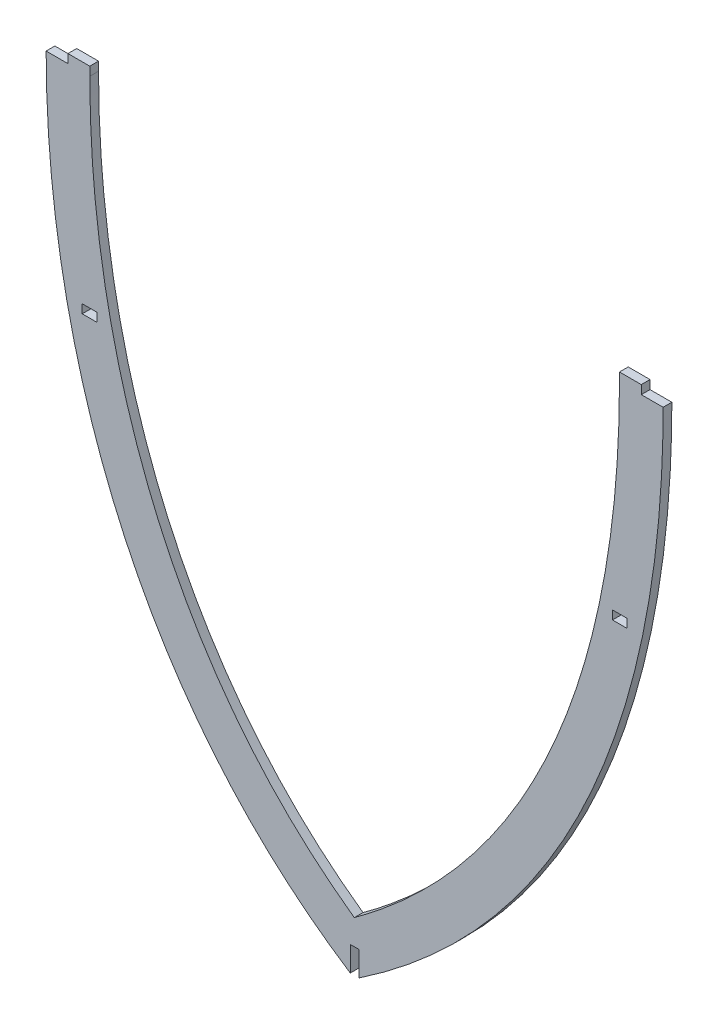
ISO-10303-21;
HEADER;
FILE_DESCRIPTION(('STEP AP214'),'2;1');
FILE_NAME('part.step','',(''),(''),'','','');
FILE_SCHEMA(('AUTOMOTIVE_DESIGN { 1 0 10303 214 1 1 1 1 }'));
ENDSEC;
DATA;
#1=APPLICATION_CONTEXT('core data for automotive mechanical design processes');
#2=APPLICATION_PROTOCOL_DEFINITION('international standard','automotive_design',2000,#1);
#3=PRODUCT_CONTEXT('',#1,'mechanical');
#4=PRODUCT('Part','Part','',(#3));
#5=PRODUCT_RELATED_PRODUCT_CATEGORY('part','',(#4));
#6=PRODUCT_DEFINITION_FORMATION('','',#4);
#7=PRODUCT_DEFINITION_CONTEXT('part definition',#1,'design');
#8=PRODUCT_DEFINITION('design','',#6,#7);
#9=PRODUCT_DEFINITION_SHAPE('','',#8);
#10=(LENGTH_UNIT() NAMED_UNIT(*) SI_UNIT(.MILLI.,.METRE.));
#11=(NAMED_UNIT(*) PLANE_ANGLE_UNIT() SI_UNIT($,.RADIAN.));
#12=(NAMED_UNIT(*) SI_UNIT($,.STERADIAN.) SOLID_ANGLE_UNIT());
#13=UNCERTAINTY_MEASURE_WITH_UNIT(LENGTH_MEASURE(1.E-05),#10,'distance_accuracy_value','');
#14=(GEOMETRIC_REPRESENTATION_CONTEXT(3) GLOBAL_UNCERTAINTY_ASSIGNED_CONTEXT((#13)) GLOBAL_UNIT_ASSIGNED_CONTEXT((#10,
#11,#12)) REPRESENTATION_CONTEXT('',''));
#15=CARTESIAN_POINT('',(0.,0.,0.));
#16=DIRECTION('',(0.,0.,1.));
#17=DIRECTION('',(1.,0.,0.));
#18=AXIS2_PLACEMENT_3D('',#15,#16,#17);
#19=CARTESIAN_POINT('',(81.0361028496675,-210.346018750039,1.5));
#20=DIRECTION('',(0.,0.,1.));
#21=DIRECTION('',(1.,0.,0.));
#22=AXIS2_PLACEMENT_3D('',#19,#20,#21);
#23=PLANE('',#22);
#24=DIRECTION('',(0.,-1.,0.));
#25=VECTOR('',#24,1.);
#26=CARTESIAN_POINT('',(-1.5000000000029,-306.089272366092,1.5));
#27=LINE('',#26,#25);
#28=CARTESIAN_POINT('',(-1.5000000000029,-296.595237141371,1.5));
#29=VERTEX_POINT('',#28);
#30=CARTESIAN_POINT('',(-1.50000000284282,-305.124153441378,1.5));
#31=VERTEX_POINT('',#30);
#32=EDGE_CURVE('E52',#29,#31,#27,.T.);
#33=ORIENTED_EDGE('',*,*,#32,.F.);
#34=DIRECTION('',(-1.,0.,0.));
#35=VECTOR('',#34,1.);
#36=CARTESIAN_POINT('',(-1.5000000000029,-296.595237141371,1.5));
#37=LINE('',#36,#35);
#38=CARTESIAN_POINT('',(1.4999999999971,-296.595237141371,1.5));
#39=VERTEX_POINT('',#38);
#40=EDGE_CURVE('E217',#39,#29,#37,.T.);
#41=ORIENTED_EDGE('',*,*,#40,.F.);
#42=DIRECTION('',(0.,1.,0.));
#43=VECTOR('',#42,1.);
#44=CARTESIAN_POINT('',(1.4999999999971,-296.595237141371,1.5));
#45=LINE('',#44,#43);
#46=CARTESIAN_POINT('',(1.4999999999971,-305.09168003954,1.5));
#47=VERTEX_POINT('',#46);
#48=EDGE_CURVE('E197',#47,#39,#45,.T.);
#49=ORIENTED_EDGE('',*,*,#48,.F.);
#50=CARTESIAN_POINT('',(0.,-306.089272366091,1.5));
#51=CARTESIAN_POINT('',(74.7629409328154,-256.782973382674,1.5));
#52=CARTESIAN_POINT('',(105.999999999723,-174.443319162066,1.5));
#53=CARTESIAN_POINT('',(105.999999999723,-82.9999999999987,1.5));
#54=B_SPLINE_CURVE_WITH_KNOTS('',3,(#50,#51,#52,#53),.UNSPECIFIED.,.F.,.F.,(4,4),(0.,1.),.UNSPECIFIED.);
#55=CARTESIAN_POINT('',(105.999999999723,-82.9999999999987,1.5));
#56=VERTEX_POINT('',#55);
#57=EDGE_CURVE('E283',#47,#56,#54,.T.);
#58=ORIENTED_EDGE('',*,*,#57,.T.);
#59=DIRECTION('',(-1.,3.27515792264421E-13,0.));
#60=VECTOR('',#59,1.);
#61=CARTESIAN_POINT('',(105.999999999723,-82.9999999999987,1.5));
#62=LINE('',#61,#60);
#63=CARTESIAN_POINT('',(98.4999999997234,-82.9999999999963,1.5));
#64=VERTEX_POINT('',#63);
#65=EDGE_CURVE('E288',#56,#64,#62,.T.);
#66=ORIENTED_EDGE('',*,*,#65,.T.);
#67=DIRECTION('',(0.,1.,0.));
#68=VECTOR('',#67,1.);
#69=CARTESIAN_POINT('',(98.4999999997234,-82.9999999999963,1.5));
#70=LINE('',#69,#68);
#71=CARTESIAN_POINT('',(98.4999999997234,-79.9999999999963,1.5));
#72=VERTEX_POINT('',#71);
#73=EDGE_CURVE('E294',#64,#72,#70,.T.);
#74=ORIENTED_EDGE('',*,*,#73,.T.);
#75=DIRECTION('',(-1.,0.,0.));
#76=VECTOR('',#75,1.);
#77=CARTESIAN_POINT('',(98.4999999997234,-79.9999999999963,1.5));
#78=LINE('',#77,#76);
#79=CARTESIAN_POINT('',(90.9999999997234,-79.9999999999963,1.5));
#80=VERTEX_POINT('',#79);
#81=EDGE_CURVE('E296',#72,#80,#78,.T.);
#82=ORIENTED_EDGE('',*,*,#81,.T.);
#83=DIRECTION('',(0.,-1.,0.));
#84=VECTOR('',#83,1.);
#85=CARTESIAN_POINT('',(90.9999999997234,-79.9999999999963,1.5));
#86=LINE('',#85,#84);
#87=CARTESIAN_POINT('',(90.9999999997234,-82.9999999999987,1.5));
#88=VERTEX_POINT('',#87);
#89=EDGE_CURVE('E298',#80,#88,#86,.T.);
#90=ORIENTED_EDGE('',*,*,#89,.T.);
#91=CARTESIAN_POINT('',(90.9999999997234,-82.9999999999987,1.5));
#92=CARTESIAN_POINT('',(90.9999999997234,-85.6320265790067,1.5));
#93=CARTESIAN_POINT('',(90.9458435478252,-90.9100451330911,1.5));
#94=CARTESIAN_POINT('',(90.6188726920127,-101.350995082174,1.5));
#95=CARTESIAN_POINT('',(89.7964262245241,-114.25256089061,1.5));
#96=CARTESIAN_POINT('',(88.1359608032648,-129.439309105091,1.5));
#97=CARTESIAN_POINT('',(85.0092889334077,-149.26190675327,1.5));
#98=CARTESIAN_POINT('',(79.3630064169406,-173.16051704898,1.5));
#99=CARTESIAN_POINT('',(69.7251540771146,-200.204558318917,1.5));
#100=CARTESIAN_POINT('',(57.1396200958412,-225.411627312857,1.5));
#101=CARTESIAN_POINT('',(44.1096758261492,-244.741072780896,1.5));
#102=CARTESIAN_POINT('',(32.0901045814584,-259.121737951226,1.5));
#103=CARTESIAN_POINT('',(22.257609380622,-269.345287034237,1.5));
#104=CARTESIAN_POINT('',(13.3559627018661,-277.38464257634,1.5));
#105=CARTESIAN_POINT('',(5.81143882708696,-283.506382083945,1.5));
#106=CARTESIAN_POINT('',(1.87081032149455,-286.480217138261,1.5));
#107=CARTESIAN_POINT('',(-0.116739635994983,-287.926353346796,1.5));
#108=B_SPLINE_CURVE_WITH_KNOTS('',3,(#91,#92,#93,#94,#95,#96,#97,#98,#99,#100,#101,#102,#103,
#104,#105,#106,#107),.UNSPECIFIED.,.F.,.F.,(4,1,1,1,1,1,1,1,1,1,1,1,1,1,4),(0.,
0.0300080345384552,0.0600160690769105,0.120032138153821,0.180048207230732,0.240064276307642,
0.360096414461463,0.480128552615284,0.600160690769105,0.720192828922926,0.780208897999837,
0.840224967076747,0.900241036153658,0.930249070692113,0.960257105230569),.UNSPECIFIED.);
#109=CARTESIAN_POINT('',(-0.116739635994983,-287.926353346796,1.5));
#110=VERTEX_POINT('',#109);
#111=EDGE_CURVE('E300',#88,#110,#108,.T.);
#112=ORIENTED_EDGE('',*,*,#111,.T.);
#113=CARTESIAN_POINT('',(-0.116739635995011,-287.926353346796,1.5));
#114=CARTESIAN_POINT('',(-2.08937323099849,-286.52106570891,1.5));
#115=CARTESIAN_POINT('',(-5.99269532623463,-283.625797901156,1.5));
#116=CARTESIAN_POINT('',(-13.4811077194996,-277.613388781886,1.5));
#117=CARTESIAN_POINT('',(-22.3248044261778,-269.642683195966,1.5));
#118=CARTESIAN_POINT('',(-32.1120088824834,-259.401886536849,1.5));
#119=CARTESIAN_POINT('',(-44.0961135302253,-244.888891231337,1.5));
#120=CARTESIAN_POINT('',(-57.1183124403138,-225.231718507734,1.5));
#121=CARTESIAN_POINT('',(-69.717388809754,-199.531988744046,1.5));
#122=CARTESIAN_POINT('',(-79.3680592473249,-172.071120857456,1.5));
#123=CARTESIAN_POINT('',(-86.1468151376409,-143.23080028757,1.5));
#124=CARTESIAN_POINT('',(-89.4716879296258,-118.377767282822,1.5));
#125=CARTESIAN_POINT('',(-90.7842249756186,-98.2204812368262,1.5));
#126=CARTESIAN_POINT('',(-91.0000000002743,-88.068550737516,1.5));
#127=CARTESIAN_POINT('',(-91.0000000002743,-82.9999999999987,1.5));
#128=B_SPLINE_CURVE_WITH_KNOTS('',3,(#113,#114,#115,#116,#117,#118,#119,#120,#121,#122,#123,
#124,#125,#126,#127),.UNSPECIFIED.,.F.,.F.,(4,1,1,1,1,1,1,1,1,1,1,1,4),(0.,0.0299917343608761,
0.0599834687217522,0.119966937443504,0.179950406165257,0.239933874887009,0.359900812330513,
0.479867749774017,0.599834687217522,0.719801624661026,0.83976856210453,0.899752030826283,
0.959735499548035),.UNSPECIFIED.);
#129=CARTESIAN_POINT('',(-91.0000000002743,-82.9999999999987,1.5));
#130=VERTEX_POINT('',#129);
#131=EDGE_CURVE('E305',#110,#130,#128,.T.);
#132=ORIENTED_EDGE('',*,*,#131,.T.);
#133=DIRECTION('',(0.,1.,0.));
#134=VECTOR('',#133,1.);
#135=CARTESIAN_POINT('',(-91.0000000002743,-79.9999999999963,1.5));
#136=LINE('',#135,#134);
#137=CARTESIAN_POINT('',(-91.0000000002743,-79.9999999999963,1.5));
#138=VERTEX_POINT('',#137);
#139=EDGE_CURVE('E478',#130,#138,#136,.T.);
#140=ORIENTED_EDGE('',*,*,#139,.T.);
#141=DIRECTION('',(-1.,0.,0.));
#142=VECTOR('',#141,1.);
#143=CARTESIAN_POINT('',(-98.5000000002743,-79.9999999999963,1.5));
#144=LINE('',#143,#142);
#145=CARTESIAN_POINT('',(-98.5000000002743,-79.9999999999963,1.5));
#146=VERTEX_POINT('',#145);
#147=EDGE_CURVE('E479',#138,#146,#144,.T.);
#148=ORIENTED_EDGE('',*,*,#147,.T.);
#149=DIRECTION('',(0.,-1.,0.));
#150=VECTOR('',#149,1.);
#151=CARTESIAN_POINT('',(-98.5000000002743,-82.9999999999963,1.5));
#152=LINE('',#151,#150);
#153=CARTESIAN_POINT('',(-98.5000000002743,-82.9999999999963,1.5));
#154=VERTEX_POINT('',#153);
#155=EDGE_CURVE('E451',#146,#154,#152,.T.);
#156=ORIENTED_EDGE('',*,*,#155,.T.);
#157=DIRECTION('',(-1.,-3.2936616397213E-13,0.));
#158=VECTOR('',#157,1.);
#159=CARTESIAN_POINT('',(-106.000000000274,-82.9999999999987,1.5));
#160=LINE('',#159,#158);
#161=CARTESIAN_POINT('',(-106.000000000274,-82.9999999999987,1.5));
#162=VERTEX_POINT('',#161);
#163=EDGE_CURVE('E367',#154,#162,#160,.T.);
#164=ORIENTED_EDGE('',*,*,#163,.T.);
#165=CARTESIAN_POINT('',(-106.000000000274,-82.9999999999987,1.5));
#166=CARTESIAN_POINT('',(-106.000000000274,-171.171703536463,1.5));
#167=CARTESIAN_POINT('',(-74.7629409325505,-258.439171974433,1.5));
#168=CARTESIAN_POINT('',(0.,-306.089272366091,1.5));
#169=B_SPLINE_CURVE_WITH_KNOTS('',3,(#165,#166,#167,#168),.UNSPECIFIED.,.F.,.F.,(4,4),(0.,1.),.UNSPECIFIED.);
#170=EDGE_CURVE('E359',#162,#31,#169,.T.);
#171=ORIENTED_EDGE('',*,*,#170,.T.);
#172=EDGE_LOOP('',(#33,#41,#49,#58,#66,#74,#82,#90,#112,#132,#140,#148,#156,#164,#171));
#173=FACE_BOUND('',#172,.T.);
#174=DIRECTION('',(-1.,0.,0.));
#175=VECTOR('',#174,1.);
#176=CARTESIAN_POINT('',(-88.6000000000001,-151.999999999998,1.5));
#177=LINE('',#176,#175);
#178=CARTESIAN_POINT('',(-88.6000000000001,-151.999999999998,1.5));
#179=VERTEX_POINT('',#178);
#180=CARTESIAN_POINT('',(-93.6000000000001,-151.999999999998,1.5));
#181=VERTEX_POINT('',#180);
#182=EDGE_CURVE('E256',#179,#181,#177,.T.);
#183=ORIENTED_EDGE('',*,*,#182,.F.);
#184=DIRECTION('',(0.,1.,0.));
#185=VECTOR('',#184,1.);
#186=CARTESIAN_POINT('',(-88.6000000000001,-154.999999999998,1.5));
#187=LINE('',#186,#185);
#188=CARTESIAN_POINT('',(-88.6000000000001,-154.999999999998,1.5));
#189=VERTEX_POINT('',#188);
#190=EDGE_CURVE('E254',#189,#179,#187,.T.);
#191=ORIENTED_EDGE('',*,*,#190,.F.);
#192=DIRECTION('',(1.,0.,0.));
#193=VECTOR('',#192,1.);
#194=CARTESIAN_POINT('',(-93.6000000000001,-154.999999999998,1.5));
#195=LINE('',#194,#193);
#196=CARTESIAN_POINT('',(-93.6000000000001,-154.999999999998,1.5));
#197=VERTEX_POINT('',#196);
#198=EDGE_CURVE('E262',#197,#189,#195,.T.);
#199=ORIENTED_EDGE('',*,*,#198,.F.);
#200=DIRECTION('',(0.,-1.,0.));
#201=VECTOR('',#200,1.);
#202=CARTESIAN_POINT('',(-93.6000000000001,-151.999999999998,1.5));
#203=LINE('',#202,#201);
#204=EDGE_CURVE('E259',#181,#197,#203,.T.);
#205=ORIENTED_EDGE('',*,*,#204,.F.);
#206=EDGE_LOOP('',(#183,#191,#199,#205));
#207=FACE_BOUND('',#206,.T.);
#208=DIRECTION('',(-1.,0.,0.));
#209=VECTOR('',#208,1.);
#210=CARTESIAN_POINT('',(93.5999999999986,-151.999999999998,1.5));
#211=LINE('',#210,#209);
#212=CARTESIAN_POINT('',(93.5999999999986,-151.999999999998,1.5));
#213=VERTEX_POINT('',#212);
#214=CARTESIAN_POINT('',(88.5999999999986,-151.999999999998,1.5));
#215=VERTEX_POINT('',#214);
#216=EDGE_CURVE('E227',#213,#215,#211,.T.);
#217=ORIENTED_EDGE('',*,*,#216,.F.);
#218=DIRECTION('',(0.,1.,0.));
#219=VECTOR('',#218,1.);
#220=CARTESIAN_POINT('',(93.5999999999986,-154.999999999998,1.5));
#221=LINE('',#220,#219);
#222=CARTESIAN_POINT('',(93.5999999999986,-154.999999999998,1.5));
#223=VERTEX_POINT('',#222);
#224=EDGE_CURVE('E225',#223,#213,#221,.T.);
#225=ORIENTED_EDGE('',*,*,#224,.F.);
#226=DIRECTION('',(1.,0.,0.));
#227=VECTOR('',#226,1.);
#228=CARTESIAN_POINT('',(88.5999999999986,-154.999999999998,1.5));
#229=LINE('',#228,#227);
#230=CARTESIAN_POINT('',(88.5999999999986,-154.999999999998,1.5));
#231=VERTEX_POINT('',#230);
#232=EDGE_CURVE('E232',#231,#223,#229,.T.);
#233=ORIENTED_EDGE('',*,*,#232,.F.);
#234=DIRECTION('',(0.,-1.,0.));
#235=VECTOR('',#234,1.);
#236=CARTESIAN_POINT('',(88.5999999999986,-151.999999999998,1.5));
#237=LINE('',#236,#235);
#238=EDGE_CURVE('E230',#215,#231,#237,.T.);
#239=ORIENTED_EDGE('',*,*,#238,.F.);
#240=EDGE_LOOP('',(#217,#225,#233,#239));
#241=FACE_BOUND('',#240,.T.);
#242=ADVANCED_FACE('F36',(#173,#207,#241),#23,.T.);
#243=CARTESIAN_POINT('',(81.0361028496675,-210.346018750039,-1.5));
#244=DIRECTION('',(0.,0.,1.));
#245=DIRECTION('',(1.,0.,0.));
#246=AXIS2_PLACEMENT_3D('',#243,#244,#245);
#247=PLANE('',#246);
#248=DIRECTION('',(0.,1.,0.));
#249=VECTOR('',#248,1.);
#250=CARTESIAN_POINT('',(-88.6000000000001,-154.999999999998,-1.5));
#251=LINE('',#250,#249);
#252=CARTESIAN_POINT('',(-88.6000000000001,-154.999999999998,-1.5));
#253=VERTEX_POINT('',#252);
#254=CARTESIAN_POINT('',(-88.6000000000001,-151.999999999998,-1.5));
#255=VERTEX_POINT('',#254);
#256=EDGE_CURVE('E253',#253,#255,#251,.T.);
#257=ORIENTED_EDGE('',*,*,#256,.T.);
#258=DIRECTION('',(-1.,0.,0.));
#259=VECTOR('',#258,1.);
#260=CARTESIAN_POINT('',(-88.6000000000001,-151.999999999998,-1.5));
#261=LINE('',#260,#259);
#262=CARTESIAN_POINT('',(-93.6000000000001,-151.999999999998,-1.5));
#263=VERTEX_POINT('',#262);
#264=EDGE_CURVE('E267',#255,#263,#261,.T.);
#265=ORIENTED_EDGE('',*,*,#264,.T.);
#266=DIRECTION('',(0.,-1.,0.));
#267=VECTOR('',#266,1.);
#268=CARTESIAN_POINT('',(-93.6000000000001,-151.999999999998,-1.5));
#269=LINE('',#268,#267);
#270=CARTESIAN_POINT('',(-93.6000000000001,-154.999999999998,-1.5));
#271=VERTEX_POINT('',#270);
#272=EDGE_CURVE('E270',#263,#271,#269,.T.);
#273=ORIENTED_EDGE('',*,*,#272,.T.);
#274=DIRECTION('',(1.,0.,0.));
#275=VECTOR('',#274,1.);
#276=CARTESIAN_POINT('',(-93.6000000000001,-154.999999999998,-1.5));
#277=LINE('',#276,#275);
#278=EDGE_CURVE('E257',#271,#253,#277,.T.);
#279=ORIENTED_EDGE('',*,*,#278,.T.);
#280=EDGE_LOOP('',(#257,#265,#273,#279));
#281=FACE_BOUND('',#280,.T.);
#282=DIRECTION('',(-1.,0.,0.));
#283=VECTOR('',#282,1.);
#284=CARTESIAN_POINT('',(-1.5000000000029,-296.595237141371,-1.5));
#285=LINE('',#284,#283);
#286=CARTESIAN_POINT('',(1.4999999999971,-296.595237141371,-1.5));
#287=VERTEX_POINT('',#286);
#288=CARTESIAN_POINT('',(-1.5000000000029,-296.595237141371,-1.5));
#289=VERTEX_POINT('',#288);
#290=EDGE_CURVE('E202',#287,#289,#285,.T.);
#291=ORIENTED_EDGE('',*,*,#290,.T.);
#292=DIRECTION('',(0.,-1.,0.));
#293=VECTOR('',#292,1.);
#294=CARTESIAN_POINT('',(-1.5000000000029,-306.089272366092,-1.5));
#295=LINE('',#294,#293);
#296=CARTESIAN_POINT('',(-1.5000000000029,-305.124153441378,-1.5));
#297=VERTEX_POINT('',#296);
#298=EDGE_CURVE('E215',#289,#297,#295,.T.);
#299=ORIENTED_EDGE('',*,*,#298,.T.);
#300=CARTESIAN_POINT('',(-106.000000000274,-82.9999999999987,-1.5));
#301=CARTESIAN_POINT('',(-106.000000000274,-171.171703536463,-1.5));
#302=CARTESIAN_POINT('',(-74.7629409325505,-258.439171974433,-1.5));
#303=CARTESIAN_POINT('',(0.,-306.089272366091,-1.5));
#304=B_SPLINE_CURVE_WITH_KNOTS('',3,(#300,#301,#302,#303),.UNSPECIFIED.,.F.,.F.,(4,4),(0.,1.),.UNSPECIFIED.);
#305=CARTESIAN_POINT('',(-106.000000000274,-82.9999999999987,-1.5));
#306=VERTEX_POINT('',#305);
#307=EDGE_CURVE('E289',#306,#297,#304,.T.);
#308=ORIENTED_EDGE('',*,*,#307,.F.);
#309=DIRECTION('',(-1.,-3.2936616397213E-13,0.));
#310=VECTOR('',#309,1.);
#311=CARTESIAN_POINT('',(-106.000000000274,-82.9999999999987,-1.5));
#312=LINE('',#311,#310);
#313=CARTESIAN_POINT('',(-98.5000000002743,-82.9999999999963,-1.5));
#314=VERTEX_POINT('',#313);
#315=EDGE_CURVE('E406',#314,#306,#312,.T.);
#316=ORIENTED_EDGE('',*,*,#315,.F.);
#317=DIRECTION('',(0.,-1.,0.));
#318=VECTOR('',#317,1.);
#319=CARTESIAN_POINT('',(-98.5000000002743,-82.9999999999963,-1.5));
#320=LINE('',#319,#318);
#321=CARTESIAN_POINT('',(-98.5000000002743,-79.9999999999963,-1.5));
#322=VERTEX_POINT('',#321);
#323=EDGE_CURVE('E404',#322,#314,#320,.T.);
#324=ORIENTED_EDGE('',*,*,#323,.F.);
#325=DIRECTION('',(-1.,0.,0.));
#326=VECTOR('',#325,1.);
#327=CARTESIAN_POINT('',(-98.5000000002743,-79.9999999999963,-1.5));
#328=LINE('',#327,#326);
#329=CARTESIAN_POINT('',(-91.0000000002743,-79.9999999999963,-1.5));
#330=VERTEX_POINT('',#329);
#331=EDGE_CURVE('E402',#330,#322,#328,.T.);
#332=ORIENTED_EDGE('',*,*,#331,.F.);
#333=DIRECTION('',(0.,1.,0.));
#334=VECTOR('',#333,1.);
#335=CARTESIAN_POINT('',(-91.0000000002743,-79.9999999999963,-1.5));
#336=LINE('',#335,#334);
#337=CARTESIAN_POINT('',(-91.0000000002743,-82.9999999999987,-1.5));
#338=VERTEX_POINT('',#337);
#339=EDGE_CURVE('E397',#338,#330,#336,.T.);
#340=ORIENTED_EDGE('',*,*,#339,.F.);
#341=CARTESIAN_POINT('',(-0.116739635995011,-287.926353346796,-1.5));
#342=CARTESIAN_POINT('',(-2.08937323099849,-286.52106570891,-1.5));
#343=CARTESIAN_POINT('',(-5.99269532623463,-283.625797901156,-1.5));
#344=CARTESIAN_POINT('',(-13.4811077194996,-277.613388781886,-1.5));
#345=CARTESIAN_POINT('',(-22.3248044261778,-269.642683195966,-1.5));
#346=CARTESIAN_POINT('',(-32.1120088824834,-259.401886536849,-1.5));
#347=CARTESIAN_POINT('',(-44.0961135302253,-244.888891231337,-1.5));
#348=CARTESIAN_POINT('',(-57.1183124403138,-225.231718507734,-1.5));
#349=CARTESIAN_POINT('',(-69.717388809754,-199.531988744046,-1.5));
#350=CARTESIAN_POINT('',(-79.3680592473249,-172.071120857456,-1.5));
#351=CARTESIAN_POINT('',(-86.1468151376409,-143.23080028757,-1.5));
#352=CARTESIAN_POINT('',(-89.4716879296258,-118.377767282822,-1.5));
#353=CARTESIAN_POINT('',(-90.7842249756186,-98.2204812368262,-1.5));
#354=CARTESIAN_POINT('',(-91.0000000002743,-88.068550737516,-1.5));
#355=CARTESIAN_POINT('',(-91.0000000002743,-82.9999999999987,-1.5));
#356=B_SPLINE_CURVE_WITH_KNOTS('',3,(#341,#342,#343,#344,#345,#346,#347,#348,#349,#350,#351,
#352,#353,#354,#355),.UNSPECIFIED.,.F.,.F.,(4,1,1,1,1,1,1,1,1,1,1,1,4),(0.,0.0299917343608761,
0.0599834687217522,0.119966937443504,0.179950406165257,0.239933874887009,0.359900812330513,
0.479867749774017,0.599834687217522,0.719801624661026,0.83976856210453,0.899752030826283,
0.959735499548035),.UNSPECIFIED.);
#357=CARTESIAN_POINT('',(-0.116739635994983,-287.926353346796,-1.5));
#358=VERTEX_POINT('',#357);
#359=EDGE_CURVE('E390',#358,#338,#356,.T.);
#360=ORIENTED_EDGE('',*,*,#359,.F.);
#361=CARTESIAN_POINT('',(90.9999999997234,-82.9999999999987,-1.5));
#362=CARTESIAN_POINT('',(90.9999999997234,-85.6320265790067,-1.5));
#363=CARTESIAN_POINT('',(90.9458435478252,-90.9100451330911,-1.5));
#364=CARTESIAN_POINT('',(90.6188726920127,-101.350995082174,-1.5));
#365=CARTESIAN_POINT('',(89.7964262245241,-114.25256089061,-1.5));
#366=CARTESIAN_POINT('',(88.1359608032648,-129.439309105091,-1.5));
#367=CARTESIAN_POINT('',(85.0092889334077,-149.26190675327,-1.5));
#368=CARTESIAN_POINT('',(79.3630064169406,-173.16051704898,-1.5));
#369=CARTESIAN_POINT('',(69.7251540771146,-200.204558318917,-1.5));
#370=CARTESIAN_POINT('',(57.1396200958412,-225.411627312857,-1.5));
#371=CARTESIAN_POINT('',(44.1096758261492,-244.741072780896,-1.5));
#372=CARTESIAN_POINT('',(32.0901045814584,-259.121737951226,-1.5));
#373=CARTESIAN_POINT('',(22.257609380622,-269.345287034237,-1.5));
#374=CARTESIAN_POINT('',(13.3559627018661,-277.38464257634,-1.5));
#375=CARTESIAN_POINT('',(5.81143882708696,-283.506382083945,-1.5));
#376=CARTESIAN_POINT('',(1.87081032149455,-286.480217138261,-1.5));
#377=CARTESIAN_POINT('',(-0.116739635994983,-287.926353346796,-1.5));
#378=B_SPLINE_CURVE_WITH_KNOTS('',3,(#361,#362,#363,#364,#365,#366,#367,#368,#369,#370,#371,
#372,#373,#374,#375,#376,#377),.UNSPECIFIED.,.F.,.F.,(4,1,1,1,1,1,1,1,1,1,1,1,1,1,4),(0.,
0.0300080345384552,0.0600160690769105,0.120032138153821,0.180048207230732,0.240064276307642,
0.360096414461463,0.480128552615284,0.600160690769105,0.720192828922926,0.780208897999837,
0.840224967076747,0.900241036153658,0.930249070692113,0.960257105230569),.UNSPECIFIED.);
#379=CARTESIAN_POINT('',(90.9999999997234,-82.9999999999987,-1.5));
#380=VERTEX_POINT('',#379);
#381=EDGE_CURVE('E386',#380,#358,#378,.T.);
#382=ORIENTED_EDGE('',*,*,#381,.F.);
#383=DIRECTION('',(0.,-1.,0.));
#384=VECTOR('',#383,1.);
#385=CARTESIAN_POINT('',(90.9999999997234,-79.9999999999963,-1.5));
#386=LINE('',#385,#384);
#387=CARTESIAN_POINT('',(90.9999999997234,-79.9999999999963,-1.5));
#388=VERTEX_POINT('',#387);
#389=EDGE_CURVE('E384',#388,#380,#386,.T.);
#390=ORIENTED_EDGE('',*,*,#389,.F.);
#391=DIRECTION('',(-1.,0.,0.));
#392=VECTOR('',#391,1.);
#393=CARTESIAN_POINT('',(98.4999999997234,-79.9999999999963,-1.5));
#394=LINE('',#393,#392);
#395=CARTESIAN_POINT('',(98.4999999997234,-79.9999999999963,-1.5));
#396=VERTEX_POINT('',#395);
#397=EDGE_CURVE('E382',#396,#388,#394,.T.);
#398=ORIENTED_EDGE('',*,*,#397,.F.);
#399=DIRECTION('',(0.,1.,0.));
#400=VECTOR('',#399,1.);
#401=CARTESIAN_POINT('',(98.4999999997234,-82.9999999999963,-1.5));
#402=LINE('',#401,#400);
#403=CARTESIAN_POINT('',(98.4999999997234,-82.9999999999963,-1.5));
#404=VERTEX_POINT('',#403);
#405=EDGE_CURVE('E380',#404,#396,#402,.T.);
#406=ORIENTED_EDGE('',*,*,#405,.F.);
#407=DIRECTION('',(-1.,3.27515792264421E-13,0.));
#408=VECTOR('',#407,1.);
#409=CARTESIAN_POINT('',(105.999999999723,-82.9999999999987,-1.5));
#410=LINE('',#409,#408);
#411=CARTESIAN_POINT('',(105.999999999723,-82.9999999999987,-1.5));
#412=VERTEX_POINT('',#411);
#413=EDGE_CURVE('E375',#412,#404,#410,.T.);
#414=ORIENTED_EDGE('',*,*,#413,.F.);
#415=CARTESIAN_POINT('',(0.,-306.089272366091,-1.5));
#416=CARTESIAN_POINT('',(74.7629409328154,-256.782973382674,-1.5));
#417=CARTESIAN_POINT('',(105.999999999723,-174.443319162066,-1.5));
#418=CARTESIAN_POINT('',(105.999999999723,-82.9999999999987,-1.5));
#419=B_SPLINE_CURVE_WITH_KNOTS('',3,(#415,#416,#417,#418),.UNSPECIFIED.,.F.,.F.,(4,4),(0.,1.),.UNSPECIFIED.);
#420=CARTESIAN_POINT('',(1.4999999999971,-305.09168003954,-1.5));
#421=VERTEX_POINT('',#420);
#422=EDGE_CURVE('E214',#421,#412,#419,.T.);
#423=ORIENTED_EDGE('',*,*,#422,.F.);
#424=DIRECTION('',(0.,1.,0.));
#425=VECTOR('',#424,1.);
#426=CARTESIAN_POINT('',(1.4999999999971,-296.595237141371,-1.5));
#427=LINE('',#426,#425);
#428=EDGE_CURVE('E195',#421,#287,#427,.T.);
#429=ORIENTED_EDGE('',*,*,#428,.T.);
#430=EDGE_LOOP('',(#291,#299,#308,#316,#324,#332,#340,#360,#382,#390,#398,#406,#414,#423,#429));
#431=FACE_BOUND('',#430,.T.);
#432=DIRECTION('',(0.,1.,0.));
#433=VECTOR('',#432,1.);
#434=CARTESIAN_POINT('',(93.5999999999986,-154.999999999998,-1.5));
#435=LINE('',#434,#433);
#436=CARTESIAN_POINT('',(93.5999999999986,-154.999999999998,-1.5));
#437=VERTEX_POINT('',#436);
#438=CARTESIAN_POINT('',(93.5999999999986,-151.999999999998,-1.5));
#439=VERTEX_POINT('',#438);
#440=EDGE_CURVE('E223',#437,#439,#435,.T.);
#441=ORIENTED_EDGE('',*,*,#440,.T.);
#442=DIRECTION('',(-1.,0.,0.));
#443=VECTOR('',#442,1.);
#444=CARTESIAN_POINT('',(93.5999999999986,-151.999999999998,-1.5));
#445=LINE('',#444,#443);
#446=CARTESIAN_POINT('',(88.5999999999986,-151.999999999998,-1.5));
#447=VERTEX_POINT('',#446);
#448=EDGE_CURVE('E237',#439,#447,#445,.T.);
#449=ORIENTED_EDGE('',*,*,#448,.T.);
#450=DIRECTION('',(0.,-1.,0.));
#451=VECTOR('',#450,1.);
#452=CARTESIAN_POINT('',(88.5999999999986,-151.999999999998,-1.5));
#453=LINE('',#452,#451);
#454=CARTESIAN_POINT('',(88.5999999999986,-154.999999999998,-1.5));
#455=VERTEX_POINT('',#454);
#456=EDGE_CURVE('E240',#447,#455,#453,.T.);
#457=ORIENTED_EDGE('',*,*,#456,.T.);
#458=DIRECTION('',(1.,0.,0.));
#459=VECTOR('',#458,1.);
#460=CARTESIAN_POINT('',(88.5999999999986,-154.999999999998,-1.5));
#461=LINE('',#460,#459);
#462=EDGE_CURVE('E228',#455,#437,#461,.T.);
#463=ORIENTED_EDGE('',*,*,#462,.T.);
#464=EDGE_LOOP('',(#441,#449,#457,#463));
#465=FACE_BOUND('',#464,.T.);
#466=ADVANCED_FACE('F211',(#281,#431,#465),#247,.F.);
#467=DIRECTION('',(0.,0.,-1.));
#468=VECTOR('',#467,1.);
#469=SURFACE_OF_LINEAR_EXTRUSION('',#54,#468);
#470=ORIENTED_EDGE('',*,*,#57,.F.);
#471=DIRECTION('',(0.,0.,-1.));
#472=VECTOR('',#471,1.);
#473=CARTESIAN_POINT('',(1.4999999999971,-305.091680041445,1.5));
#474=LINE('',#473,#472);
#475=EDGE_CURVE('E11',#47,#421,#474,.T.);
#476=ORIENTED_EDGE('',*,*,#475,.T.);
#477=ORIENTED_EDGE('',*,*,#422,.T.);
#478=DIRECTION('',(0.,0.,-1.));
#479=VECTOR('',#478,1.);
#480=CARTESIAN_POINT('',(105.999999999723,-82.9999999999987,1.5));
#481=LINE('',#480,#479);
#482=EDGE_CURVE('E444',#56,#412,#481,.T.);
#483=ORIENTED_EDGE('',*,*,#482,.F.);
#484=EDGE_LOOP('',(#470,#476,#477,#483));
#485=FACE_BOUND('',#484,.T.);
#486=ADVANCED_FACE('F38',(#485),#469,.F.);
#487=CARTESIAN_POINT('',(105.999999999723,-82.9999999999987,1.5));
#488=DIRECTION('',(-3.27515792264421E-13,-1.,0.));
#489=DIRECTION('',(1.,-3.27515792264421E-13,0.));
#490=AXIS2_PLACEMENT_3D('',#487,#488,#489);
#491=PLANE('',#490);
#492=ORIENTED_EDGE('',*,*,#413,.T.);
#493=DIRECTION('',(0.,0.,-1.));
#494=VECTOR('',#493,1.);
#495=CARTESIAN_POINT('',(98.4999999997234,-82.9999999999963,1.5));
#496=LINE('',#495,#494);
#497=EDGE_CURVE('E441',#64,#404,#496,.T.);
#498=ORIENTED_EDGE('',*,*,#497,.F.);
#499=ORIENTED_EDGE('',*,*,#65,.F.);
#500=ORIENTED_EDGE('',*,*,#482,.T.);
#501=EDGE_LOOP('',(#492,#498,#499,#500));
#502=FACE_BOUND('',#501,.T.);
#503=ADVANCED_FACE('F331',(#502),#491,.F.);
#504=CARTESIAN_POINT('',(98.4999999997234,-82.9999999999963,1.5));
#505=DIRECTION('',(-1.,0.,0.));
#506=DIRECTION('',(0.,0.,1.));
#507=AXIS2_PLACEMENT_3D('',#504,#505,#506);
#508=PLANE('',#507);
#509=ORIENTED_EDGE('',*,*,#405,.T.);
#510=DIRECTION('',(0.,0.,-1.));
#511=VECTOR('',#510,1.);
#512=CARTESIAN_POINT('',(98.4999999997234,-79.9999999999963,1.5));
#513=LINE('',#512,#511);
#514=EDGE_CURVE('E438',#72,#396,#513,.T.);
#515=ORIENTED_EDGE('',*,*,#514,.F.);
#516=ORIENTED_EDGE('',*,*,#73,.F.);
#517=ORIENTED_EDGE('',*,*,#497,.T.);
#518=EDGE_LOOP('',(#509,#515,#516,#517));
#519=FACE_BOUND('',#518,.T.);
#520=ADVANCED_FACE('F328',(#519),#508,.F.);
#521=CARTESIAN_POINT('',(98.4999999997234,-79.9999999999963,1.5));
#522=DIRECTION('',(0.,-1.,0.));
#523=DIRECTION('',(0.,0.,-1.));
#524=AXIS2_PLACEMENT_3D('',#521,#522,#523);
#525=PLANE('',#524);
#526=ORIENTED_EDGE('',*,*,#397,.T.);
#527=DIRECTION('',(0.,0.,-1.));
#528=VECTOR('',#527,1.);
#529=CARTESIAN_POINT('',(90.9999999997234,-79.9999999999963,1.5));
#530=LINE('',#529,#528);
#531=EDGE_CURVE('E435',#80,#388,#530,.T.);
#532=ORIENTED_EDGE('',*,*,#531,.F.);
#533=ORIENTED_EDGE('',*,*,#81,.F.);
#534=ORIENTED_EDGE('',*,*,#514,.T.);
#535=EDGE_LOOP('',(#526,#532,#533,#534));
#536=FACE_BOUND('',#535,.T.);
#537=ADVANCED_FACE('F324',(#536),#525,.F.);
#538=CARTESIAN_POINT('',(90.9999999997234,-79.9999999999963,1.5));
#539=DIRECTION('',(1.,0.,0.));
#540=DIRECTION('',(0.,0.,-1.));
#541=AXIS2_PLACEMENT_3D('',#538,#539,#540);
#542=PLANE('',#541);
#543=ORIENTED_EDGE('',*,*,#389,.T.);
#544=DIRECTION('',(0.,0.,-1.));
#545=VECTOR('',#544,1.);
#546=CARTESIAN_POINT('',(90.9999999997234,-82.9999999999987,1.5));
#547=LINE('',#546,#545);
#548=EDGE_CURVE('E432',#88,#380,#547,.T.);
#549=ORIENTED_EDGE('',*,*,#548,.F.);
#550=ORIENTED_EDGE('',*,*,#89,.F.);
#551=ORIENTED_EDGE('',*,*,#531,.T.);
#552=EDGE_LOOP('',(#543,#549,#550,#551));
#553=FACE_BOUND('',#552,.T.);
#554=ADVANCED_FACE('F319',(#553),#542,.F.);
#555=DIRECTION('',(0.,0.,-1.));
#556=VECTOR('',#555,1.);
#557=SURFACE_OF_LINEAR_EXTRUSION('',#108,#556);
#558=ORIENTED_EDGE('',*,*,#381,.T.);
#559=DIRECTION('',(0.,0.,-1.));
#560=VECTOR('',#559,1.);
#561=CARTESIAN_POINT('',(-0.116739635994983,-287.926353346796,1.5));
#562=LINE('',#561,#560);
#563=EDGE_CURVE('E429',#110,#358,#562,.T.);
#564=ORIENTED_EDGE('',*,*,#563,.F.);
#565=ORIENTED_EDGE('',*,*,#111,.F.);
#566=ORIENTED_EDGE('',*,*,#548,.T.);
#567=EDGE_LOOP('',(#558,#564,#565,#566));
#568=FACE_BOUND('',#567,.T.);
#569=ADVANCED_FACE('F314',(#568),#557,.F.);
#570=DIRECTION('',(0.,0.,-1.));
#571=VECTOR('',#570,1.);
#572=SURFACE_OF_LINEAR_EXTRUSION('',#128,#571);
#573=ORIENTED_EDGE('',*,*,#359,.T.);
#574=DIRECTION('',(0.,0.,-1.));
#575=VECTOR('',#574,1.);
#576=CARTESIAN_POINT('',(-91.0000000002743,-82.9999999999987,1.5));
#577=LINE('',#576,#575);
#578=EDGE_CURVE('E426',#130,#338,#577,.T.);
#579=ORIENTED_EDGE('',*,*,#578,.F.);
#580=ORIENTED_EDGE('',*,*,#131,.F.);
#581=ORIENTED_EDGE('',*,*,#563,.T.);
#582=EDGE_LOOP('',(#573,#579,#580,#581));
#583=FACE_BOUND('',#582,.T.);
#584=ADVANCED_FACE('F318',(#583),#572,.F.);
#585=CARTESIAN_POINT('',(-91.0000000002743,-79.9999999999963,1.5));
#586=DIRECTION('',(-1.,0.,0.));
#587=DIRECTION('',(0.,0.,1.));
#588=AXIS2_PLACEMENT_3D('',#585,#586,#587);
#589=PLANE('',#588);
#590=ORIENTED_EDGE('',*,*,#339,.T.);
#591=DIRECTION('',(0.,0.,-1.));
#592=VECTOR('',#591,1.);
#593=CARTESIAN_POINT('',(-91.0000000002743,-79.9999999999963,1.5));
#594=LINE('',#593,#592);
#595=EDGE_CURVE('E423',#138,#330,#594,.T.);
#596=ORIENTED_EDGE('',*,*,#595,.F.);
#597=ORIENTED_EDGE('',*,*,#139,.F.);
#598=ORIENTED_EDGE('',*,*,#578,.T.);
#599=EDGE_LOOP('',(#590,#596,#597,#598));
#600=FACE_BOUND('',#599,.T.);
#601=ADVANCED_FACE('F491',(#600),#589,.F.);
#602=CARTESIAN_POINT('',(-98.5000000002743,-79.9999999999963,1.5));
#603=DIRECTION('',(0.,-1.,0.));
#604=DIRECTION('',(0.,0.,-1.));
#605=AXIS2_PLACEMENT_3D('',#602,#603,#604);
#606=PLANE('',#605);
#607=ORIENTED_EDGE('',*,*,#331,.T.);
#608=DIRECTION('',(0.,0.,-1.));
#609=VECTOR('',#608,1.);
#610=CARTESIAN_POINT('',(-98.5000000002743,-79.9999999999963,1.5));
#611=LINE('',#610,#609);
#612=EDGE_CURVE('E420',#146,#322,#611,.T.);
#613=ORIENTED_EDGE('',*,*,#612,.F.);
#614=ORIENTED_EDGE('',*,*,#147,.F.);
#615=ORIENTED_EDGE('',*,*,#595,.T.);
#616=EDGE_LOOP('',(#607,#613,#614,#615));
#617=FACE_BOUND('',#616,.T.);
#618=ADVANCED_FACE('F485',(#617),#606,.F.);
#619=CARTESIAN_POINT('',(-98.5000000002743,-82.9999999999963,1.5));
#620=DIRECTION('',(1.,0.,0.));
#621=DIRECTION('',(0.,0.,-1.));
#622=AXIS2_PLACEMENT_3D('',#619,#620,#621);
#623=PLANE('',#622);
#624=ORIENTED_EDGE('',*,*,#323,.T.);
#625=DIRECTION('',(0.,0.,-1.));
#626=VECTOR('',#625,1.);
#627=CARTESIAN_POINT('',(-98.5000000002743,-82.9999999999963,1.5));
#628=LINE('',#627,#626);
#629=EDGE_CURVE('E417',#154,#314,#628,.T.);
#630=ORIENTED_EDGE('',*,*,#629,.F.);
#631=ORIENTED_EDGE('',*,*,#155,.F.);
#632=ORIENTED_EDGE('',*,*,#612,.T.);
#633=EDGE_LOOP('',(#624,#630,#631,#632));
#634=FACE_BOUND('',#633,.T.);
#635=ADVANCED_FACE('F488',(#634),#623,.F.);
#636=CARTESIAN_POINT('',(-106.000000000274,-82.9999999999987,1.5));
#637=DIRECTION('',(3.2936616397213E-13,-1.,0.));
#638=DIRECTION('',(1.,3.2936616397213E-13,0.));
#639=AXIS2_PLACEMENT_3D('',#636,#637,#638);
#640=PLANE('',#639);
#641=ORIENTED_EDGE('',*,*,#315,.T.);
#642=DIRECTION('',(0.,0.,-1.));
#643=VECTOR('',#642,1.);
#644=CARTESIAN_POINT('',(-106.000000000274,-82.9999999999987,1.5));
#645=LINE('',#644,#643);
#646=EDGE_CURVE('E366',#162,#306,#645,.T.);
#647=ORIENTED_EDGE('',*,*,#646,.F.);
#648=ORIENTED_EDGE('',*,*,#163,.F.);
#649=ORIENTED_EDGE('',*,*,#629,.T.);
#650=EDGE_LOOP('',(#641,#647,#648,#649));
#651=FACE_BOUND('',#650,.T.);
#652=ADVANCED_FACE('F356',(#651),#640,.F.);
#653=DIRECTION('',(0.,0.,-1.));
#654=VECTOR('',#653,1.);
#655=SURFACE_OF_LINEAR_EXTRUSION('',#169,#654);
#656=ORIENTED_EDGE('',*,*,#307,.T.);
#657=DIRECTION('',(0.,0.,-1.));
#658=VECTOR('',#657,1.);
#659=CARTESIAN_POINT('',(-1.5000000000029,-305.124153443222,1.5));
#660=LINE('',#659,#658);
#661=EDGE_CURVE('E45',#297,#31,#660,.F.);
#662=ORIENTED_EDGE('',*,*,#661,.T.);
#663=ORIENTED_EDGE('',*,*,#170,.F.);
#664=ORIENTED_EDGE('',*,*,#646,.T.);
#665=EDGE_LOOP('',(#656,#662,#663,#664));
#666=FACE_BOUND('',#665,.T.);
#667=ADVANCED_FACE('F352',(#666),#655,.F.);
#668=CARTESIAN_POINT('',(-88.6000000000001,-154.999999999998,1.5));
#669=DIRECTION('',(-1.,0.,0.));
#670=DIRECTION('',(0.,0.,1.));
#671=AXIS2_PLACEMENT_3D('',#668,#669,#670);
#672=PLANE('',#671);
#673=ORIENTED_EDGE('',*,*,#256,.F.);
#674=DIRECTION('',(0.,0.,-1.));
#675=VECTOR('',#674,1.);
#676=CARTESIAN_POINT('',(-88.6000000000001,-154.999999999998,1.5));
#677=LINE('',#676,#675);
#678=EDGE_CURVE('E264',#189,#253,#677,.T.);
#679=ORIENTED_EDGE('',*,*,#678,.F.);
#680=ORIENTED_EDGE('',*,*,#190,.T.);
#681=DIRECTION('',(0.,0.,-1.));
#682=VECTOR('',#681,1.);
#683=CARTESIAN_POINT('',(-88.6000000000001,-151.999999999998,1.5));
#684=LINE('',#683,#682);
#685=EDGE_CURVE('E281',#179,#255,#684,.T.);
#686=ORIENTED_EDGE('',*,*,#685,.T.);
#687=EDGE_LOOP('',(#673,#679,#680,#686));
#688=FACE_BOUND('',#687,.T.);
#689=ADVANCED_FACE('F349',(#688),#672,.T.);
#690=CARTESIAN_POINT('',(-88.6000000000001,-151.999999999998,1.5));
#691=DIRECTION('',(0.,-1.,0.));
#692=DIRECTION('',(0.,0.,-1.));
#693=AXIS2_PLACEMENT_3D('',#690,#691,#692);
#694=PLANE('',#693);
#695=ORIENTED_EDGE('',*,*,#264,.F.);
#696=ORIENTED_EDGE('',*,*,#685,.F.);
#697=ORIENTED_EDGE('',*,*,#182,.T.);
#698=DIRECTION('',(0.,0.,-1.));
#699=VECTOR('',#698,1.);
#700=CARTESIAN_POINT('',(-93.6000000000001,-151.999999999998,1.5));
#701=LINE('',#700,#699);
#702=EDGE_CURVE('E279',#181,#263,#701,.T.);
#703=ORIENTED_EDGE('',*,*,#702,.T.);
#704=EDGE_LOOP('',(#695,#696,#697,#703));
#705=FACE_BOUND('',#704,.T.);
#706=ADVANCED_FACE('F516',(#705),#694,.T.);
#707=CARTESIAN_POINT('',(-93.6000000000001,-151.999999999998,1.5));
#708=DIRECTION('',(1.,0.,0.));
#709=DIRECTION('',(0.,0.,-1.));
#710=AXIS2_PLACEMENT_3D('',#707,#708,#709);
#711=PLANE('',#710);
#712=ORIENTED_EDGE('',*,*,#272,.F.);
#713=ORIENTED_EDGE('',*,*,#702,.F.);
#714=ORIENTED_EDGE('',*,*,#204,.T.);
#715=DIRECTION('',(0.,0.,-1.));
#716=VECTOR('',#715,1.);
#717=CARTESIAN_POINT('',(-93.6000000000001,-154.999999999998,1.5));
#718=LINE('',#717,#716);
#719=EDGE_CURVE('E277',#197,#271,#718,.T.);
#720=ORIENTED_EDGE('',*,*,#719,.T.);
#721=EDGE_LOOP('',(#712,#713,#714,#720));
#722=FACE_BOUND('',#721,.T.);
#723=ADVANCED_FACE('F523',(#722),#711,.T.);
#724=CARTESIAN_POINT('',(-93.6000000000001,-154.999999999998,1.5));
#725=DIRECTION('',(0.,1.,0.));
#726=DIRECTION('',(0.,0.,1.));
#727=AXIS2_PLACEMENT_3D('',#724,#725,#726);
#728=PLANE('',#727);
#729=ORIENTED_EDGE('',*,*,#278,.F.);
#730=ORIENTED_EDGE('',*,*,#719,.F.);
#731=ORIENTED_EDGE('',*,*,#198,.T.);
#732=ORIENTED_EDGE('',*,*,#678,.T.);
#733=EDGE_LOOP('',(#729,#730,#731,#732));
#734=FACE_BOUND('',#733,.T.);
#735=ADVANCED_FACE('F530',(#734),#728,.T.);
#736=CARTESIAN_POINT('',(93.5999999999986,-154.999999999998,1.5));
#737=DIRECTION('',(-1.,0.,0.));
#738=DIRECTION('',(0.,0.,1.));
#739=AXIS2_PLACEMENT_3D('',#736,#737,#738);
#740=PLANE('',#739);
#741=ORIENTED_EDGE('',*,*,#440,.F.);
#742=DIRECTION('',(0.,0.,-1.));
#743=VECTOR('',#742,1.);
#744=CARTESIAN_POINT('',(93.5999999999986,-154.999999999998,1.5));
#745=LINE('',#744,#743);
#746=EDGE_CURVE('E234',#223,#437,#745,.T.);
#747=ORIENTED_EDGE('',*,*,#746,.F.);
#748=ORIENTED_EDGE('',*,*,#224,.T.);
#749=DIRECTION('',(0.,0.,-1.));
#750=VECTOR('',#749,1.);
#751=CARTESIAN_POINT('',(93.5999999999986,-151.999999999998,1.5));
#752=LINE('',#751,#750);
#753=EDGE_CURVE('E250',#213,#439,#752,.T.);
#754=ORIENTED_EDGE('',*,*,#753,.T.);
#755=EDGE_LOOP('',(#741,#747,#748,#754));
#756=FACE_BOUND('',#755,.T.);
#757=ADVANCED_FACE('F538',(#756),#740,.T.);
#758=CARTESIAN_POINT('',(93.5999999999986,-151.999999999998,1.5));
#759=DIRECTION('',(0.,-1.,0.));
#760=DIRECTION('',(0.,0.,-1.));
#761=AXIS2_PLACEMENT_3D('',#758,#759,#760);
#762=PLANE('',#761);
#763=ORIENTED_EDGE('',*,*,#448,.F.);
#764=ORIENTED_EDGE('',*,*,#753,.F.);
#765=ORIENTED_EDGE('',*,*,#216,.T.);
#766=DIRECTION('',(0.,0.,-1.));
#767=VECTOR('',#766,1.);
#768=CARTESIAN_POINT('',(88.5999999999986,-151.999999999998,1.5));
#769=LINE('',#768,#767);
#770=EDGE_CURVE('E248',#215,#447,#769,.T.);
#771=ORIENTED_EDGE('',*,*,#770,.T.);
#772=EDGE_LOOP('',(#763,#764,#765,#771));
#773=FACE_BOUND('',#772,.T.);
#774=ADVANCED_FACE('F546',(#773),#762,.T.);
#775=CARTESIAN_POINT('',(88.5999999999986,-151.999999999998,1.5));
#776=DIRECTION('',(1.,0.,0.));
#777=DIRECTION('',(0.,0.,-1.));
#778=AXIS2_PLACEMENT_3D('',#775,#776,#777);
#779=PLANE('',#778);
#780=ORIENTED_EDGE('',*,*,#456,.F.);
#781=ORIENTED_EDGE('',*,*,#770,.F.);
#782=ORIENTED_EDGE('',*,*,#238,.T.);
#783=DIRECTION('',(0.,0.,-1.));
#784=VECTOR('',#783,1.);
#785=CARTESIAN_POINT('',(88.5999999999986,-154.999999999998,1.5));
#786=LINE('',#785,#784);
#787=EDGE_CURVE('E60',#231,#455,#786,.T.);
#788=ORIENTED_EDGE('',*,*,#787,.T.);
#789=EDGE_LOOP('',(#780,#781,#782,#788));
#790=FACE_BOUND('',#789,.T.);
#791=ADVANCED_FACE('F554',(#790),#779,.T.);
#792=CARTESIAN_POINT('',(88.5999999999986,-154.999999999998,1.5));
#793=DIRECTION('',(0.,1.,0.));
#794=DIRECTION('',(0.,0.,1.));
#795=AXIS2_PLACEMENT_3D('',#792,#793,#794);
#796=PLANE('',#795);
#797=ORIENTED_EDGE('',*,*,#462,.F.);
#798=ORIENTED_EDGE('',*,*,#787,.F.);
#799=ORIENTED_EDGE('',*,*,#232,.T.);
#800=ORIENTED_EDGE('',*,*,#746,.T.);
#801=EDGE_LOOP('',(#797,#798,#799,#800));
#802=FACE_BOUND('',#801,.T.);
#803=ADVANCED_FACE('F562',(#802),#796,.T.);
#804=CARTESIAN_POINT('',(1.4999999999971,-296.595237141371,-1.5));
#805=DIRECTION('',(1.,0.,0.));
#806=DIRECTION('',(0.,0.,-1.));
#807=AXIS2_PLACEMENT_3D('',#804,#805,#806);
#808=PLANE('',#807);
#809=ORIENTED_EDGE('',*,*,#48,.T.);
#810=DIRECTION('',(0.,0.,1.));
#811=VECTOR('',#810,1.);
#812=CARTESIAN_POINT('',(1.4999999999971,-296.595237141371,-1.5));
#813=LINE('',#812,#811);
#814=EDGE_CURVE('E191',#287,#39,#813,.T.);
#815=ORIENTED_EDGE('',*,*,#814,.F.);
#816=ORIENTED_EDGE('',*,*,#428,.F.);
#817=ORIENTED_EDGE('',*,*,#475,.F.);
#818=EDGE_LOOP('',(#809,#815,#816,#817));
#819=FACE_BOUND('',#818,.T.);
#820=ADVANCED_FACE('F193',(#819),#808,.F.);
#821=CARTESIAN_POINT('',(-1.5000000000029,-306.089272366092,-1.5));
#822=DIRECTION('',(-1.,0.,0.));
#823=DIRECTION('',(0.,0.,1.));
#824=AXIS2_PLACEMENT_3D('',#821,#822,#823);
#825=PLANE('',#824);
#826=ORIENTED_EDGE('',*,*,#298,.F.);
#827=DIRECTION('',(0.,0.,1.));
#828=VECTOR('',#827,1.);
#829=CARTESIAN_POINT('',(-1.5000000000029,-296.595237141371,-1.5));
#830=LINE('',#829,#828);
#831=EDGE_CURVE('E201',#289,#29,#830,.T.);
#832=ORIENTED_EDGE('',*,*,#831,.T.);
#833=ORIENTED_EDGE('',*,*,#32,.T.);
#834=ORIENTED_EDGE('',*,*,#661,.F.);
#835=EDGE_LOOP('',(#826,#832,#833,#834));
#836=FACE_BOUND('',#835,.T.);
#837=ADVANCED_FACE('F456',(#836),#825,.F.);
#838=CARTESIAN_POINT('',(-1.5000000000029,-296.595237141371,-1.5));
#839=DIRECTION('',(0.,1.,0.));
#840=DIRECTION('',(0.,0.,1.));
#841=AXIS2_PLACEMENT_3D('',#838,#839,#840);
#842=PLANE('',#841);
#843=ORIENTED_EDGE('',*,*,#40,.T.);
#844=ORIENTED_EDGE('',*,*,#831,.F.);
#845=ORIENTED_EDGE('',*,*,#290,.F.);
#846=ORIENTED_EDGE('',*,*,#814,.T.);
#847=EDGE_LOOP('',(#843,#844,#845,#846));
#848=FACE_BOUND('',#847,.T.);
#849=ADVANCED_FACE('F205',(#848),#842,.F.);
#850=CLOSED_SHELL('',(#242,#466,#486,#503,#520,#537,#554,#569,#584,#601,#618,#635,#652,#667,
#689,#706,#723,#735,#757,#774,#791,#803,#820,#837,#849));
#851=MANIFOLD_SOLID_BREP('B2',#850);
#852=ADVANCED_BREP_SHAPE_REPRESENTATION('',(#18,#851),#14);
#853=SHAPE_DEFINITION_REPRESENTATION(#9,#852);
ENDSEC;
END-ISO-10303-21;
